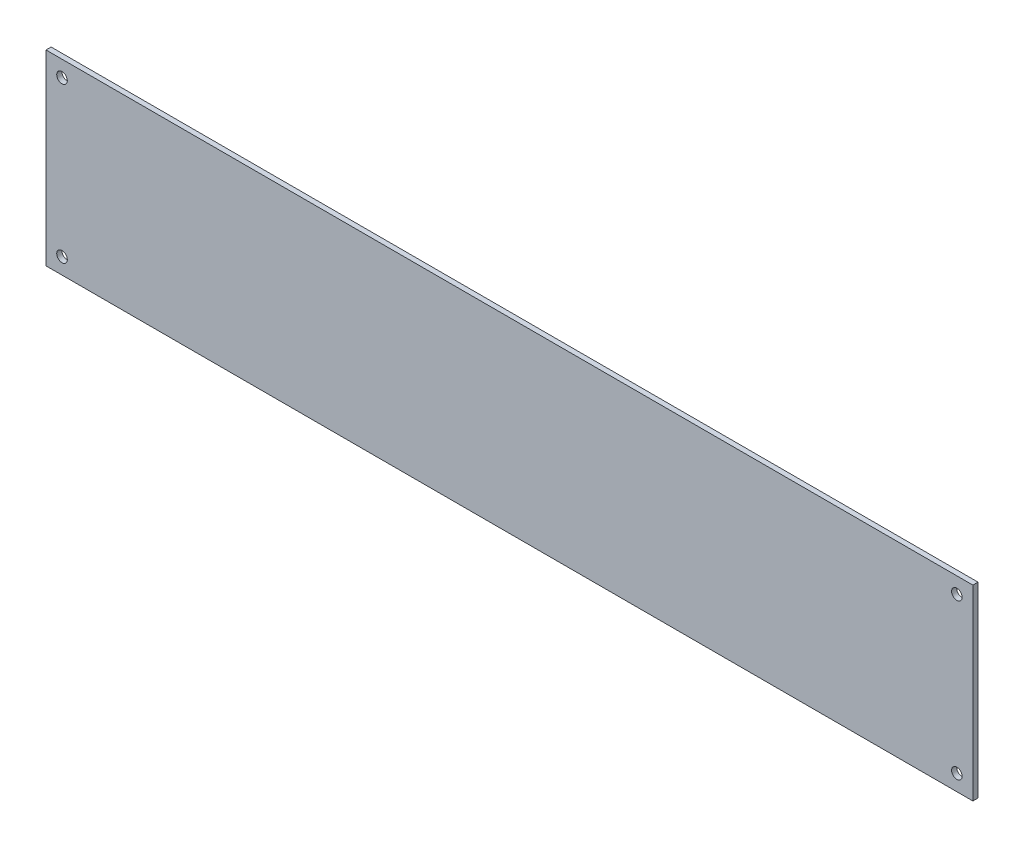
ISO-10303-21;
HEADER;
FILE_DESCRIPTION(('STEP AP214'),'2;1');
FILE_NAME('part.step','',(''),(''),'','','');
FILE_SCHEMA(('AUTOMOTIVE_DESIGN { 1 0 10303 214 1 1 1 1 }'));
ENDSEC;
DATA;
#1=APPLICATION_CONTEXT('core data for automotive mechanical design processes');
#2=APPLICATION_PROTOCOL_DEFINITION('international standard','automotive_design',2000,#1);
#3=PRODUCT_CONTEXT('',#1,'mechanical');
#4=PRODUCT('Part','Part','',(#3));
#5=PRODUCT_RELATED_PRODUCT_CATEGORY('part','',(#4));
#6=PRODUCT_DEFINITION_FORMATION('','',#4);
#7=PRODUCT_DEFINITION_CONTEXT('part definition',#1,'design');
#8=PRODUCT_DEFINITION('design','',#6,#7);
#9=PRODUCT_DEFINITION_SHAPE('','',#8);
#10=(LENGTH_UNIT() NAMED_UNIT(*) SI_UNIT(.MILLI.,.METRE.));
#11=(NAMED_UNIT(*) PLANE_ANGLE_UNIT() SI_UNIT($,.RADIAN.));
#12=(NAMED_UNIT(*) SI_UNIT($,.STERADIAN.) SOLID_ANGLE_UNIT());
#13=UNCERTAINTY_MEASURE_WITH_UNIT(LENGTH_MEASURE(1.E-05),#10,'distance_accuracy_value','');
#14=(GEOMETRIC_REPRESENTATION_CONTEXT(3) GLOBAL_UNCERTAINTY_ASSIGNED_CONTEXT((#13)) GLOBAL_UNIT_ASSIGNED_CONTEXT((#10,
#11,#12)) REPRESENTATION_CONTEXT('',''));
#15=CARTESIAN_POINT('',(0.,0.,0.));
#16=DIRECTION('',(0.,0.,1.));
#17=DIRECTION('',(1.,0.,0.));
#18=AXIS2_PLACEMENT_3D('',#15,#16,#17);
#19=CARTESIAN_POINT('',(0.,0.,-1.6));
#20=DIRECTION('',(-1.,0.,0.));
#21=DIRECTION('',(0.,0.,1.));
#22=AXIS2_PLACEMENT_3D('',#19,#20,#21);
#23=PLANE('',#22);
#24=DIRECTION('',(0.,-1.,0.));
#25=VECTOR('',#24,1.);
#26=CARTESIAN_POINT('',(0.,0.,0.));
#27=LINE('',#26,#25);
#28=CARTESIAN_POINT('',(0.,58.42,0.));
#29=VERTEX_POINT('',#28);
#30=CARTESIAN_POINT('',(0.,0.,0.));
#31=VERTEX_POINT('',#30);
#32=EDGE_CURVE('E98',#29,#31,#27,.T.);
#33=ORIENTED_EDGE('',*,*,#32,.F.);
#34=DIRECTION('',(0.,0.,1.));
#35=VECTOR('',#34,1.);
#36=CARTESIAN_POINT('',(0.,58.42,-1.6));
#37=LINE('',#36,#35);
#38=CARTESIAN_POINT('',(0.,58.42,-1.6));
#39=VERTEX_POINT('',#38);
#40=EDGE_CURVE('E11',#39,#29,#37,.T.);
#41=ORIENTED_EDGE('',*,*,#40,.F.);
#42=DIRECTION('',(0.,-1.,0.));
#43=VECTOR('',#42,1.);
#44=CARTESIAN_POINT('',(0.,0.,-1.6));
#45=LINE('',#44,#43);
#46=CARTESIAN_POINT('',(0.,0.,-1.6));
#47=VERTEX_POINT('',#46);
#48=EDGE_CURVE('E91',#39,#47,#45,.T.);
#49=ORIENTED_EDGE('',*,*,#48,.T.);
#50=DIRECTION('',(0.,0.,1.));
#51=VECTOR('',#50,1.);
#52=CARTESIAN_POINT('',(0.,0.,-1.6));
#53=LINE('',#52,#51);
#54=EDGE_CURVE('E36',#47,#31,#53,.T.);
#55=ORIENTED_EDGE('',*,*,#54,.T.);
#56=EDGE_LOOP('',(#33,#41,#49,#55));
#57=FACE_BOUND('',#56,.T.);
#58=ADVANCED_FACE('F33',(#57),#23,.T.);
#59=CARTESIAN_POINT('',(0.,58.42,-1.6));
#60=DIRECTION('',(0.,1.,0.));
#61=DIRECTION('',(0.,0.,1.));
#62=AXIS2_PLACEMENT_3D('',#59,#60,#61);
#63=PLANE('',#62);
#64=DIRECTION('',(-1.,0.,0.));
#65=VECTOR('',#64,1.);
#66=CARTESIAN_POINT('',(0.,58.42,0.));
#67=LINE('',#66,#65);
#68=CARTESIAN_POINT('',(289.561,58.42,0.));
#69=VERTEX_POINT('',#68);
#70=EDGE_CURVE('E93',#69,#29,#67,.T.);
#71=ORIENTED_EDGE('',*,*,#70,.F.);
#72=DIRECTION('',(0.,0.,1.));
#73=VECTOR('',#72,1.);
#74=CARTESIAN_POINT('',(289.561,58.42,-1.6));
#75=LINE('',#74,#73);
#76=CARTESIAN_POINT('',(289.561,58.42,-1.6));
#77=VERTEX_POINT('',#76);
#78=EDGE_CURVE('E42',#77,#69,#75,.T.);
#79=ORIENTED_EDGE('',*,*,#78,.F.);
#80=DIRECTION('',(-1.,0.,0.));
#81=VECTOR('',#80,1.);
#82=CARTESIAN_POINT('',(0.,58.42,-1.6));
#83=LINE('',#82,#81);
#84=EDGE_CURVE('E88',#77,#39,#83,.T.);
#85=ORIENTED_EDGE('',*,*,#84,.T.);
#86=ORIENTED_EDGE('',*,*,#40,.T.);
#87=EDGE_LOOP('',(#71,#79,#85,#86));
#88=FACE_BOUND('',#87,.T.);
#89=ADVANCED_FACE('F109',(#88),#63,.T.);
#90=CARTESIAN_POINT('',(289.561,0.,-1.6));
#91=DIRECTION('',(1.,0.,0.));
#92=DIRECTION('',(0.,0.,-1.));
#93=AXIS2_PLACEMENT_3D('',#90,#91,#92);
#94=PLANE('',#93);
#95=DIRECTION('',(0.,1.,0.));
#96=VECTOR('',#95,1.);
#97=CARTESIAN_POINT('',(289.561,0.,0.));
#98=LINE('',#97,#96);
#99=CARTESIAN_POINT('',(289.561,0.,0.));
#100=VERTEX_POINT('',#99);
#101=EDGE_CURVE('E83',#100,#69,#98,.T.);
#102=ORIENTED_EDGE('',*,*,#101,.F.);
#103=DIRECTION('',(0.,0.,1.));
#104=VECTOR('',#103,1.);
#105=CARTESIAN_POINT('',(289.561,0.,-1.6));
#106=LINE('',#105,#104);
#107=CARTESIAN_POINT('',(289.561,0.,-1.6));
#108=VERTEX_POINT('',#107);
#109=EDGE_CURVE('E78',#108,#100,#106,.T.);
#110=ORIENTED_EDGE('',*,*,#109,.F.);
#111=DIRECTION('',(0.,1.,0.));
#112=VECTOR('',#111,1.);
#113=CARTESIAN_POINT('',(289.561,0.,-1.6));
#114=LINE('',#113,#112);
#115=EDGE_CURVE('E81',#108,#77,#114,.T.);
#116=ORIENTED_EDGE('',*,*,#115,.T.);
#117=ORIENTED_EDGE('',*,*,#78,.T.);
#118=EDGE_LOOP('',(#102,#110,#116,#117));
#119=FACE_BOUND('',#118,.T.);
#120=ADVANCED_FACE('F80',(#119),#94,.T.);
#121=CARTESIAN_POINT('',(0.,0.,-1.6));
#122=DIRECTION('',(0.,-1.,0.));
#123=DIRECTION('',(0.,0.,-1.));
#124=AXIS2_PLACEMENT_3D('',#121,#122,#123);
#125=PLANE('',#124);
#126=DIRECTION('',(1.,0.,0.));
#127=VECTOR('',#126,1.);
#128=CARTESIAN_POINT('',(0.,0.,0.));
#129=LINE('',#128,#127);
#130=EDGE_CURVE('E101',#31,#100,#129,.T.);
#131=ORIENTED_EDGE('',*,*,#130,.F.);
#132=ORIENTED_EDGE('',*,*,#54,.F.);
#133=DIRECTION('',(1.,0.,0.));
#134=VECTOR('',#133,1.);
#135=CARTESIAN_POINT('',(0.,0.,-1.6));
#136=LINE('',#135,#134);
#137=EDGE_CURVE('E87',#47,#108,#136,.T.);
#138=ORIENTED_EDGE('',*,*,#137,.T.);
#139=ORIENTED_EDGE('',*,*,#109,.T.);
#140=EDGE_LOOP('',(#131,#132,#138,#139));
#141=FACE_BOUND('',#140,.T.);
#142=ADVANCED_FACE('F90',(#141),#125,.T.);
#143=CARTESIAN_POINT('',(0.,0.,-1.6));
#144=DIRECTION('',(0.,0.,-1.));
#145=DIRECTION('',(-1.,0.,0.));
#146=AXIS2_PLACEMENT_3D('',#143,#144,#145);
#147=PLANE('',#146);
#148=CARTESIAN_POINT('',(5.,5.,-1.6));
#149=DIRECTION('',(0.,0.,1.));
#150=DIRECTION('',(1.,0.,0.));
#151=AXIS2_PLACEMENT_3D('',#148,#149,#150);
#152=CIRCLE('',#151,1.65);
#153=CARTESIAN_POINT('',(6.65,5.,-1.6));
#154=VERTEX_POINT('',#153);
#155=EDGE_CURVE('E150',#154,#154,#152,.T.);
#156=ORIENTED_EDGE('',*,*,#155,.T.);
#157=EDGE_LOOP('',(#156));
#158=FACE_BOUND('',#157,.T.);
#159=CARTESIAN_POINT('',(5.,53.42,-1.6));
#160=DIRECTION('',(0.,0.,1.));
#161=DIRECTION('',(1.,0.,0.));
#162=AXIS2_PLACEMENT_3D('',#159,#160,#161);
#163=CIRCLE('',#162,1.65);
#164=CARTESIAN_POINT('',(6.65,53.42,-1.6));
#165=VERTEX_POINT('',#164);
#166=EDGE_CURVE('E158',#165,#165,#163,.T.);
#167=ORIENTED_EDGE('',*,*,#166,.T.);
#168=EDGE_LOOP('',(#167));
#169=FACE_BOUND('',#168,.T.);
#170=CARTESIAN_POINT('',(284.561,53.42,-1.6));
#171=DIRECTION('',(0.,0.,1.));
#172=DIRECTION('',(1.,0.,0.));
#173=AXIS2_PLACEMENT_3D('',#170,#171,#172);
#174=CIRCLE('',#173,1.64999999999999);
#175=CARTESIAN_POINT('',(286.211,53.42,-1.6));
#176=VERTEX_POINT('',#175);
#177=EDGE_CURVE('E164',#176,#176,#174,.T.);
#178=ORIENTED_EDGE('',*,*,#177,.T.);
#179=EDGE_LOOP('',(#178));
#180=FACE_BOUND('',#179,.T.);
#181=CARTESIAN_POINT('',(284.561,5.,-1.6));
#182=DIRECTION('',(0.,0.,1.));
#183=DIRECTION('',(1.,0.,0.));
#184=AXIS2_PLACEMENT_3D('',#181,#182,#183);
#185=CIRCLE('',#184,1.64999999999999);
#186=CARTESIAN_POINT('',(286.211,5.,-1.6));
#187=VERTEX_POINT('',#186);
#188=EDGE_CURVE('E102',#187,#187,#185,.T.);
#189=ORIENTED_EDGE('',*,*,#188,.T.);
#190=EDGE_LOOP('',(#189));
#191=FACE_BOUND('',#190,.T.);
#192=ORIENTED_EDGE('',*,*,#48,.F.);
#193=ORIENTED_EDGE('',*,*,#84,.F.);
#194=ORIENTED_EDGE('',*,*,#115,.F.);
#195=ORIENTED_EDGE('',*,*,#137,.F.);
#196=EDGE_LOOP('',(#192,#193,#194,#195));
#197=FACE_BOUND('',#196,.T.);
#198=ADVANCED_FACE('F86',(#158,#169,#180,#191,#197),#147,.T.);
#199=CARTESIAN_POINT('',(0.,0.,0.));
#200=DIRECTION('',(0.,0.,-1.));
#201=DIRECTION('',(-1.,0.,0.));
#202=AXIS2_PLACEMENT_3D('',#199,#200,#201);
#203=PLANE('',#202);
#204=CARTESIAN_POINT('',(5.,5.,0.));
#205=DIRECTION('',(0.,0.,1.));
#206=DIRECTION('',(1.,0.,0.));
#207=AXIS2_PLACEMENT_3D('',#204,#205,#206);
#208=CIRCLE('',#207,1.65);
#209=CARTESIAN_POINT('',(6.65,5.,0.));
#210=VERTEX_POINT('',#209);
#211=EDGE_CURVE('E153',#210,#210,#208,.T.);
#212=ORIENTED_EDGE('',*,*,#211,.F.);
#213=EDGE_LOOP('',(#212));
#214=FACE_BOUND('',#213,.T.);
#215=CARTESIAN_POINT('',(5.,53.42,0.));
#216=DIRECTION('',(0.,0.,1.));
#217=DIRECTION('',(1.,0.,0.));
#218=AXIS2_PLACEMENT_3D('',#215,#216,#217);
#219=CIRCLE('',#218,1.65);
#220=CARTESIAN_POINT('',(6.65,53.42,0.));
#221=VERTEX_POINT('',#220);
#222=EDGE_CURVE('E155',#221,#221,#219,.T.);
#223=ORIENTED_EDGE('',*,*,#222,.F.);
#224=EDGE_LOOP('',(#223));
#225=FACE_BOUND('',#224,.T.);
#226=CARTESIAN_POINT('',(284.561,53.42,0.));
#227=DIRECTION('',(0.,0.,1.));
#228=DIRECTION('',(1.,0.,0.));
#229=AXIS2_PLACEMENT_3D('',#226,#227,#228);
#230=CIRCLE('',#229,1.64999999999999);
#231=CARTESIAN_POINT('',(286.211,53.42,0.));
#232=VERTEX_POINT('',#231);
#233=EDGE_CURVE('E161',#232,#232,#230,.T.);
#234=ORIENTED_EDGE('',*,*,#233,.F.);
#235=EDGE_LOOP('',(#234));
#236=FACE_BOUND('',#235,.T.);
#237=CARTESIAN_POINT('',(284.561,5.,0.));
#238=DIRECTION('',(0.,0.,1.));
#239=DIRECTION('',(1.,0.,0.));
#240=AXIS2_PLACEMENT_3D('',#237,#238,#239);
#241=CIRCLE('',#240,1.64999999999999);
#242=CARTESIAN_POINT('',(286.211,5.,0.));
#243=VERTEX_POINT('',#242);
#244=EDGE_CURVE('E167',#243,#243,#241,.T.);
#245=ORIENTED_EDGE('',*,*,#244,.F.);
#246=EDGE_LOOP('',(#245));
#247=FACE_BOUND('',#246,.T.);
#248=ORIENTED_EDGE('',*,*,#32,.T.);
#249=ORIENTED_EDGE('',*,*,#130,.T.);
#250=ORIENTED_EDGE('',*,*,#101,.T.);
#251=ORIENTED_EDGE('',*,*,#70,.T.);
#252=EDGE_LOOP('',(#248,#249,#250,#251));
#253=FACE_BOUND('',#252,.T.);
#254=ADVANCED_FACE('F108',(#214,#225,#236,#247,#253),#203,.F.);
#255=CARTESIAN_POINT('',(284.561,5.,-1.6));
#256=DIRECTION('',(0.,0.,1.));
#257=DIRECTION('',(1.,0.,0.));
#258=AXIS2_PLACEMENT_3D('',#255,#256,#257);
#259=CYLINDRICAL_SURFACE('',#258,1.64999999999999);
#260=ORIENTED_EDGE('',*,*,#188,.F.);
#261=EDGE_LOOP('',(#260));
#262=FACE_BOUND('',#261,.T.);
#263=ORIENTED_EDGE('',*,*,#244,.T.);
#264=EDGE_LOOP('',(#263));
#265=FACE_BOUND('',#264,.T.);
#266=ADVANCED_FACE('F127',(#262,#265),#259,.F.);
#267=CARTESIAN_POINT('',(284.561,53.42,-1.6));
#268=DIRECTION('',(0.,0.,1.));
#269=DIRECTION('',(1.,0.,0.));
#270=AXIS2_PLACEMENT_3D('',#267,#268,#269);
#271=CYLINDRICAL_SURFACE('',#270,1.64999999999999);
#272=ORIENTED_EDGE('',*,*,#177,.F.);
#273=EDGE_LOOP('',(#272));
#274=FACE_BOUND('',#273,.T.);
#275=ORIENTED_EDGE('',*,*,#233,.T.);
#276=EDGE_LOOP('',(#275));
#277=FACE_BOUND('',#276,.T.);
#278=ADVANCED_FACE('F134',(#274,#277),#271,.F.);
#279=CARTESIAN_POINT('',(5.,53.42,-1.6));
#280=DIRECTION('',(0.,0.,1.));
#281=DIRECTION('',(1.,0.,0.));
#282=AXIS2_PLACEMENT_3D('',#279,#280,#281);
#283=CYLINDRICAL_SURFACE('',#282,1.65);
#284=ORIENTED_EDGE('',*,*,#166,.F.);
#285=EDGE_LOOP('',(#284));
#286=FACE_BOUND('',#285,.T.);
#287=ORIENTED_EDGE('',*,*,#222,.T.);
#288=EDGE_LOOP('',(#287));
#289=FACE_BOUND('',#288,.T.);
#290=ADVANCED_FACE('F138',(#286,#289),#283,.F.);
#291=CARTESIAN_POINT('',(5.,5.,-1.6));
#292=DIRECTION('',(0.,0.,1.));
#293=DIRECTION('',(1.,0.,0.));
#294=AXIS2_PLACEMENT_3D('',#291,#292,#293);
#295=CYLINDRICAL_SURFACE('',#294,1.65);
#296=ORIENTED_EDGE('',*,*,#155,.F.);
#297=EDGE_LOOP('',(#296));
#298=FACE_BOUND('',#297,.T.);
#299=ORIENTED_EDGE('',*,*,#211,.T.);
#300=EDGE_LOOP('',(#299));
#301=FACE_BOUND('',#300,.T.);
#302=ADVANCED_FACE('F142',(#298,#301),#295,.F.);
#303=CLOSED_SHELL('',(#58,#89,#120,#142,#198,#254,#266,#278,#290,#302));
#304=MANIFOLD_SOLID_BREP('B2',#303);
#305=ADVANCED_BREP_SHAPE_REPRESENTATION('',(#18,#304),#14);
#306=SHAPE_DEFINITION_REPRESENTATION(#9,#305);
ENDSEC;
END-ISO-10303-21;
